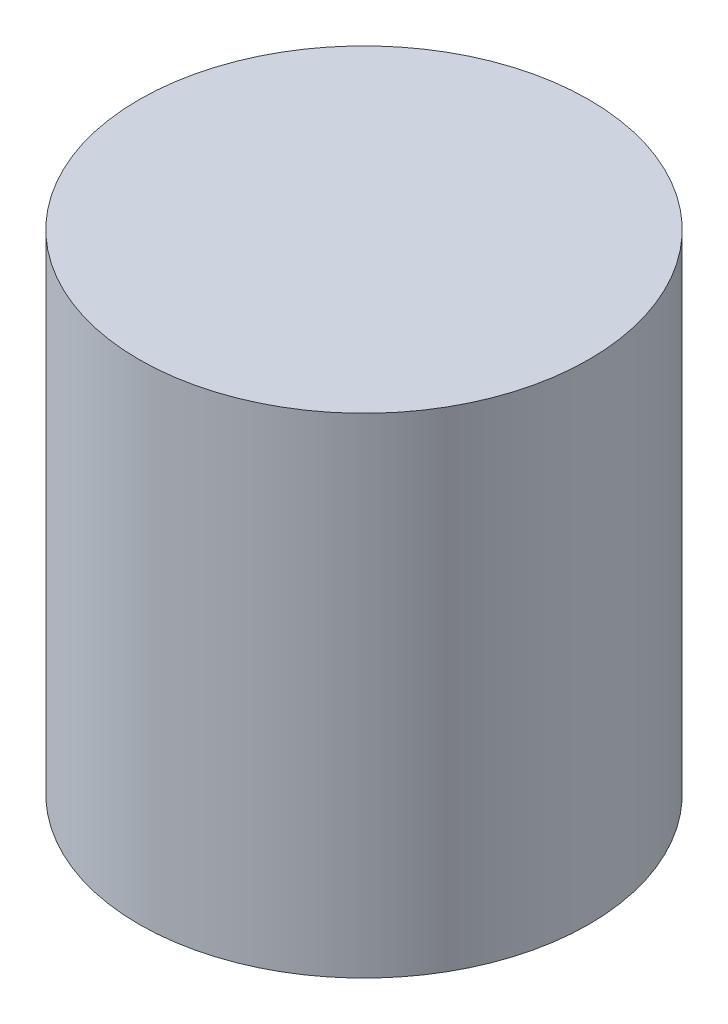
ISO-10303-21;
HEADER;
FILE_DESCRIPTION(('STEP AP214'),'2;1');
FILE_NAME('part.step','',(''),(''),'','','');
FILE_SCHEMA(('AUTOMOTIVE_DESIGN { 1 0 10303 214 1 1 1 1 }'));
ENDSEC;
DATA;
#1=APPLICATION_CONTEXT('core data for automotive mechanical design processes');
#2=APPLICATION_PROTOCOL_DEFINITION('international standard','automotive_design',2000,#1);
#3=PRODUCT_CONTEXT('',#1,'mechanical');
#4=PRODUCT('Part','Part','',(#3));
#5=PRODUCT_RELATED_PRODUCT_CATEGORY('part','',(#4));
#6=PRODUCT_DEFINITION_FORMATION('','',#4);
#7=PRODUCT_DEFINITION_CONTEXT('part definition',#1,'design');
#8=PRODUCT_DEFINITION('design','',#6,#7);
#9=PRODUCT_DEFINITION_SHAPE('','',#8);
#10=(LENGTH_UNIT() NAMED_UNIT(*) SI_UNIT(.MILLI.,.METRE.));
#11=(NAMED_UNIT(*) PLANE_ANGLE_UNIT() SI_UNIT($,.RADIAN.));
#12=(NAMED_UNIT(*) SI_UNIT($,.STERADIAN.) SOLID_ANGLE_UNIT());
#13=UNCERTAINTY_MEASURE_WITH_UNIT(LENGTH_MEASURE(1.E-05),#10,'distance_accuracy_value','');
#14=(GEOMETRIC_REPRESENTATION_CONTEXT(3) GLOBAL_UNCERTAINTY_ASSIGNED_CONTEXT((#13)) GLOBAL_UNIT_ASSIGNED_CONTEXT((#10,
#11,#12)) REPRESENTATION_CONTEXT('',''));
#15=CARTESIAN_POINT('',(0.,0.,0.));
#16=DIRECTION('',(0.,0.,1.));
#17=DIRECTION('',(1.,0.,0.));
#18=AXIS2_PLACEMENT_3D('',#15,#16,#17);
#19=CARTESIAN_POINT('',(153.821054168489,19.5388607110586,-6.34999999999998));
#20=DIRECTION('',(0.,-1.,0.));
#21=DIRECTION('',(1.,0.,0.));
#22=AXIS2_PLACEMENT_3D('',#19,#20,#21);
#23=CYLINDRICAL_SURFACE('',#22,2.921);
#24=CARTESIAN_POINT('',(153.821054168489,19.5388607110586,-6.34999999999998));
#25=DIRECTION('',(0.,1.,0.));
#26=DIRECTION('',(-1.,0.,0.));
#27=AXIS2_PLACEMENT_3D('',#24,#25,#26);
#28=CIRCLE('',#27,2.921);
#29=CARTESIAN_POINT('',(150.900054168489,19.5388607110586,-6.34999999999998));
#30=VERTEX_POINT('',#29);
#31=EDGE_CURVE('E10',#30,#30,#28,.T.);
#32=ORIENTED_EDGE('',*,*,#31,.F.);
#33=EDGE_LOOP('',(#32));
#34=FACE_BOUND('',#33,.T.);
#35=CARTESIAN_POINT('',(153.821054168489,13.1888607110586,-6.34999999999998));
#36=DIRECTION('',(0.,1.,0.));
#37=DIRECTION('',(-1.,0.,0.));
#38=AXIS2_PLACEMENT_3D('',#35,#36,#37);
#39=CIRCLE('',#38,2.921);
#40=CARTESIAN_POINT('',(150.900054168489,13.1888607110586,-6.34999999999998));
#41=VERTEX_POINT('',#40);
#42=EDGE_CURVE('E40',#41,#41,#39,.T.);
#43=ORIENTED_EDGE('',*,*,#42,.T.);
#44=EDGE_LOOP('',(#43));
#45=FACE_BOUND('',#44,.T.);
#46=ADVANCED_FACE('F37',(#34,#45),#23,.T.);
#47=CARTESIAN_POINT('',(0.,19.5388607110586,0.));
#48=DIRECTION('',(0.,1.,0.));
#49=DIRECTION('',(-1.,0.,0.));
#50=AXIS2_PLACEMENT_3D('',#47,#48,#49);
#51=PLANE('',#50);
#52=ORIENTED_EDGE('',*,*,#31,.T.);
#53=EDGE_LOOP('',(#52));
#54=FACE_BOUND('',#53,.T.);
#55=ADVANCED_FACE('F52',(#54),#51,.T.);
#56=CARTESIAN_POINT('',(0.,13.1888607110586,0.));
#57=DIRECTION('',(0.,1.,0.));
#58=DIRECTION('',(-1.,0.,0.));
#59=AXIS2_PLACEMENT_3D('',#56,#57,#58);
#60=PLANE('',#59);
#61=ORIENTED_EDGE('',*,*,#42,.F.);
#62=EDGE_LOOP('',(#61));
#63=FACE_BOUND('',#62,.T.);
#64=ADVANCED_FACE('F50',(#63),#60,.F.);
#65=CLOSED_SHELL('',(#46,#55,#64));
#66=MANIFOLD_SOLID_BREP('B2',#65);
#67=ADVANCED_BREP_SHAPE_REPRESENTATION('',(#18,#66),#14);
#68=SHAPE_DEFINITION_REPRESENTATION(#9,#67);
ENDSEC;
END-ISO-10303-21;
